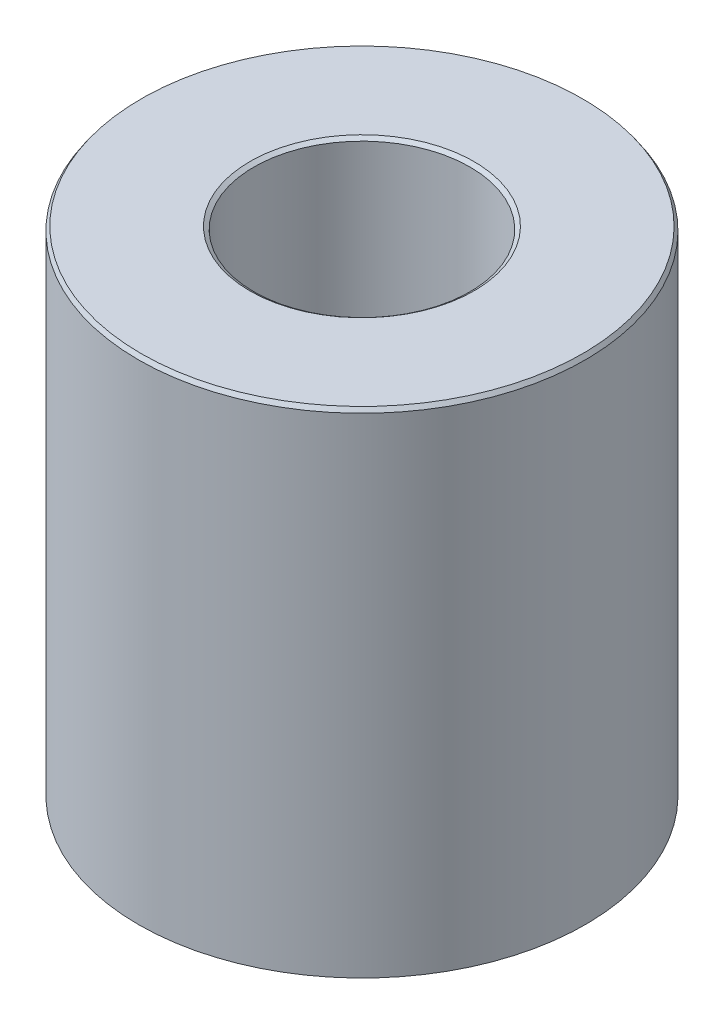
ISO-10303-21;
HEADER;
FILE_DESCRIPTION(('STEP AP214'),'2;1');
FILE_NAME('part.step','',(''),(''),'','','');
FILE_SCHEMA(('AUTOMOTIVE_DESIGN { 1 0 10303 214 1 1 1 1 }'));
ENDSEC;
DATA;
#1=APPLICATION_CONTEXT('core data for automotive mechanical design processes');
#2=APPLICATION_PROTOCOL_DEFINITION('international standard','automotive_design',2000,#1);
#3=PRODUCT_CONTEXT('',#1,'mechanical');
#4=PRODUCT('Part','Part','',(#3));
#5=PRODUCT_RELATED_PRODUCT_CATEGORY('part','',(#4));
#6=PRODUCT_DEFINITION_FORMATION('','',#4);
#7=PRODUCT_DEFINITION_CONTEXT('part definition',#1,'design');
#8=PRODUCT_DEFINITION('design','',#6,#7);
#9=PRODUCT_DEFINITION_SHAPE('','',#8);
#10=(LENGTH_UNIT() NAMED_UNIT(*) SI_UNIT(.MILLI.,.METRE.));
#11=(NAMED_UNIT(*) PLANE_ANGLE_UNIT() SI_UNIT($,.RADIAN.));
#12=(NAMED_UNIT(*) SI_UNIT($,.STERADIAN.) SOLID_ANGLE_UNIT());
#13=UNCERTAINTY_MEASURE_WITH_UNIT(LENGTH_MEASURE(1.E-05),#10,'distance_accuracy_value','');
#14=(GEOMETRIC_REPRESENTATION_CONTEXT(3) GLOBAL_UNCERTAINTY_ASSIGNED_CONTEXT((#13)) GLOBAL_UNIT_ASSIGNED_CONTEXT((#10,
#11,#12)) REPRESENTATION_CONTEXT('',''));
#15=CARTESIAN_POINT('',(0.,0.,0.));
#16=DIRECTION('',(0.,0.,1.));
#17=DIRECTION('',(1.,0.,0.));
#18=AXIS2_PLACEMENT_3D('',#15,#16,#17);
#19=CARTESIAN_POINT('',(0.,110.940527977645,0.));
#20=DIRECTION('',(0.,-1.,0.));
#21=DIRECTION('',(0.,0.,-1.));
#22=AXIS2_PLACEMENT_3D('',#19,#20,#21);
#23=CYLINDRICAL_SURFACE('',#22,50.);
#24=CARTESIAN_POINT('',(0.,0.611338028914124,0.));
#25=DIRECTION('',(0.,1.,0.));
#26=DIRECTION('',(0.,0.,1.));
#27=AXIS2_PLACEMENT_3D('',#24,#25,#26);
#28=CIRCLE('',#27,50.);
#29=CARTESIAN_POINT('',(0.,0.611338028914124,50.));
#30=VERTEX_POINT('',#29);
#31=EDGE_CURVE('E10',#30,#30,#28,.T.);
#32=ORIENTED_EDGE('',*,*,#31,.T.);
#33=EDGE_LOOP('',(#32));
#34=FACE_BOUND('',#33,.T.);
#35=CARTESIAN_POINT('',(0.,110.046069929924,0.));
#36=DIRECTION('',(0.,1.,0.));
#37=DIRECTION('',(0.,0.,1.));
#38=AXIS2_PLACEMENT_3D('',#35,#36,#37);
#39=CIRCLE('',#38,50.);
#40=CARTESIAN_POINT('',(0.,110.046069929924,50.));
#41=VERTEX_POINT('',#40);
#42=EDGE_CURVE('E50',#41,#41,#39,.F.);
#43=ORIENTED_EDGE('',*,*,#42,.T.);
#44=EDGE_LOOP('',(#43));
#45=FACE_BOUND('',#44,.T.);
#46=ADVANCED_FACE('F39',(#34,#45),#23,.T.);
#47=CARTESIAN_POINT('',(0.,110.940527977645,0.));
#48=DIRECTION('',(0.,1.,0.));
#49=DIRECTION('',(0.,0.,1.));
#50=AXIS2_PLACEMENT_3D('',#47,#48,#49);
#51=PLANE('',#50);
#52=CARTESIAN_POINT('',(0.,110.940527977645,0.));
#53=DIRECTION('',(0.,1.,0.));
#54=DIRECTION('',(0.,0.,1.));
#55=AXIS2_PLACEMENT_3D('',#52,#53,#54);
#56=CIRCLE('',#55,25.07839884392);
#57=CARTESIAN_POINT('',(0.,110.940527977645,25.07839884392));
#58=VERTEX_POINT('',#57);
#59=EDGE_CURVE('E58',#58,#58,#56,.F.);
#60=ORIENTED_EDGE('',*,*,#59,.T.);
#61=EDGE_LOOP('',(#60));
#62=FACE_BOUND('',#61,.T.);
#63=CARTESIAN_POINT('',(0.,110.940527977645,0.));
#64=DIRECTION('',(0.,1.,0.));
#65=DIRECTION('',(0.,0.,1.));
#66=AXIS2_PLACEMENT_3D('',#63,#64,#65);
#67=CIRCLE('',#66,49.3886619710859);
#68=CARTESIAN_POINT('',(0.,110.940527977645,49.3886619710859));
#69=VERTEX_POINT('',#68);
#70=EDGE_CURVE('E61',#69,#69,#67,.T.);
#71=ORIENTED_EDGE('',*,*,#70,.T.);
#72=EDGE_LOOP('',(#71));
#73=FACE_BOUND('',#72,.T.);
#74=ADVANCED_FACE('F88',(#62,#73),#51,.T.);
#75=CARTESIAN_POINT('',(0.,0.,0.));
#76=DIRECTION('',(0.,1.,0.));
#77=DIRECTION('',(0.,0.,1.));
#78=AXIS2_PLACEMENT_3D('',#75,#76,#77);
#79=PLANE('',#78);
#80=CARTESIAN_POINT('',(0.,0.,0.));
#81=DIRECTION('',(0.,1.,0.));
#82=DIRECTION('',(0.,0.,1.));
#83=AXIS2_PLACEMENT_3D('',#80,#81,#82);
#84=CIRCLE('',#83,24.7952788251128);
#85=CARTESIAN_POINT('',(0.,0.,24.7952788251128));
#86=VERTEX_POINT('',#85);
#87=EDGE_CURVE('E51',#86,#86,#84,.T.);
#88=ORIENTED_EDGE('',*,*,#87,.T.);
#89=EDGE_LOOP('',(#88));
#90=FACE_BOUND('',#89,.T.);
#91=CARTESIAN_POINT('',(0.,0.,0.));
#92=DIRECTION('',(0.,1.,0.));
#93=DIRECTION('',(0.,0.,1.));
#94=AXIS2_PLACEMENT_3D('',#91,#92,#93);
#95=CIRCLE('',#94,49.1055419522787);
#96=CARTESIAN_POINT('',(0.,0.,49.1055419522787));
#97=VERTEX_POINT('',#96);
#98=EDGE_CURVE('E54',#97,#97,#95,.F.);
#99=ORIENTED_EDGE('',*,*,#98,.T.);
#100=EDGE_LOOP('',(#99));
#101=FACE_BOUND('',#100,.T.);
#102=ADVANCED_FACE('F83',(#90,#101),#79,.F.);
#103=CARTESIAN_POINT('',(0.,110.940527977645,0.));
#104=DIRECTION('',(0.,-1.,0.));
#105=DIRECTION('',(0.,0.,-1.));
#106=AXIS2_PLACEMENT_3D('',#103,#104,#105);
#107=CYLINDRICAL_SURFACE('',#106,24.1839407961987);
#108=CARTESIAN_POINT('',(0.,110.329189948731,0.));
#109=DIRECTION('',(0.,1.,0.));
#110=DIRECTION('',(0.,0.,1.));
#111=AXIS2_PLACEMENT_3D('',#108,#109,#110);
#112=CIRCLE('',#111,24.1839407961987);
#113=CARTESIAN_POINT('',(0.,110.329189948731,24.1839407961987));
#114=VERTEX_POINT('',#113);
#115=EDGE_CURVE('E67',#114,#114,#112,.T.);
#116=ORIENTED_EDGE('',*,*,#115,.T.);
#117=EDGE_LOOP('',(#116));
#118=FACE_BOUND('',#117,.T.);
#119=CARTESIAN_POINT('',(0.,0.894458047721342,0.));
#120=DIRECTION('',(0.,1.,0.));
#121=DIRECTION('',(0.,0.,1.));
#122=AXIS2_PLACEMENT_3D('',#119,#120,#121);
#123=CIRCLE('',#122,24.1839407961987);
#124=CARTESIAN_POINT('',(0.,0.894458047721342,24.1839407961987));
#125=VERTEX_POINT('',#124);
#126=EDGE_CURVE('E69',#125,#125,#123,.F.);
#127=ORIENTED_EDGE('',*,*,#126,.T.);
#128=EDGE_LOOP('',(#127));
#129=FACE_BOUND('',#128,.T.);
#130=ADVANCED_FACE('F71',(#118,#129),#107,.F.);
#131=CARTESIAN_POINT('',(0.,110.329189948731,0.));
#132=DIRECTION('',(0.,1.,0.));
#133=DIRECTION('',(0.,0.,1.));
#134=AXIS2_PLACEMENT_3D('',#131,#132,#133);
#135=CONICAL_SURFACE('',#134,24.1839407961987,0.971248559912059);
#136=ORIENTED_EDGE('',*,*,#59,.F.);
#137=EDGE_LOOP('',(#136));
#138=FACE_BOUND('',#137,.T.);
#139=ORIENTED_EDGE('',*,*,#115,.F.);
#140=EDGE_LOOP('',(#139));
#141=FACE_BOUND('',#140,.T.);
#142=ADVANCED_FACE('F77',(#138,#141),#135,.F.);
#143=CARTESIAN_POINT('',(0.,0.,0.));
#144=DIRECTION('',(0.,-1.,0.));
#145=DIRECTION('',(0.,0.,-1.));
#146=AXIS2_PLACEMENT_3D('',#143,#144,#145);
#147=CONICAL_SURFACE('',#146,24.7952788251128,0.59954776688283);
#148=ORIENTED_EDGE('',*,*,#126,.F.);
#149=EDGE_LOOP('',(#148));
#150=FACE_BOUND('',#149,.T.);
#151=ORIENTED_EDGE('',*,*,#87,.F.);
#152=EDGE_LOOP('',(#151));
#153=FACE_BOUND('',#152,.T.);
#154=ADVANCED_FACE('F73',(#150,#153),#147,.F.);
#155=CARTESIAN_POINT('',(0.,0.611338028914124,0.));
#156=DIRECTION('',(0.,1.,0.));
#157=DIRECTION('',(0.,0.,1.));
#158=AXIS2_PLACEMENT_3D('',#155,#156,#157);
#159=CONICAL_SURFACE('',#158,50.,0.97124855991206);
#160=ORIENTED_EDGE('',*,*,#98,.F.);
#161=EDGE_LOOP('',(#160));
#162=FACE_BOUND('',#161,.T.);
#163=ORIENTED_EDGE('',*,*,#31,.F.);
#164=EDGE_LOOP('',(#163));
#165=FACE_BOUND('',#164,.T.);
#166=ADVANCED_FACE('F76',(#162,#165),#159,.T.);
#167=CARTESIAN_POINT('',(0.,110.940527977645,0.));
#168=DIRECTION('',(0.,-1.,0.));
#169=DIRECTION('',(0.,0.,-1.));
#170=AXIS2_PLACEMENT_3D('',#167,#168,#169);
#171=CONICAL_SURFACE('',#170,49.3886619710859,0.599547766882819);
#172=ORIENTED_EDGE('',*,*,#42,.F.);
#173=EDGE_LOOP('',(#172));
#174=FACE_BOUND('',#173,.T.);
#175=ORIENTED_EDGE('',*,*,#70,.F.);
#176=EDGE_LOOP('',(#175));
#177=FACE_BOUND('',#176,.T.);
#178=ADVANCED_FACE('F45',(#174,#177),#171,.T.);
#179=CLOSED_SHELL('',(#46,#74,#102,#130,#142,#154,#166,#178));
#180=MANIFOLD_SOLID_BREP('B2',#179);
#181=ADVANCED_BREP_SHAPE_REPRESENTATION('',(#18,#180),#14);
#182=SHAPE_DEFINITION_REPRESENTATION(#9,#181);
ENDSEC;
END-ISO-10303-21;
